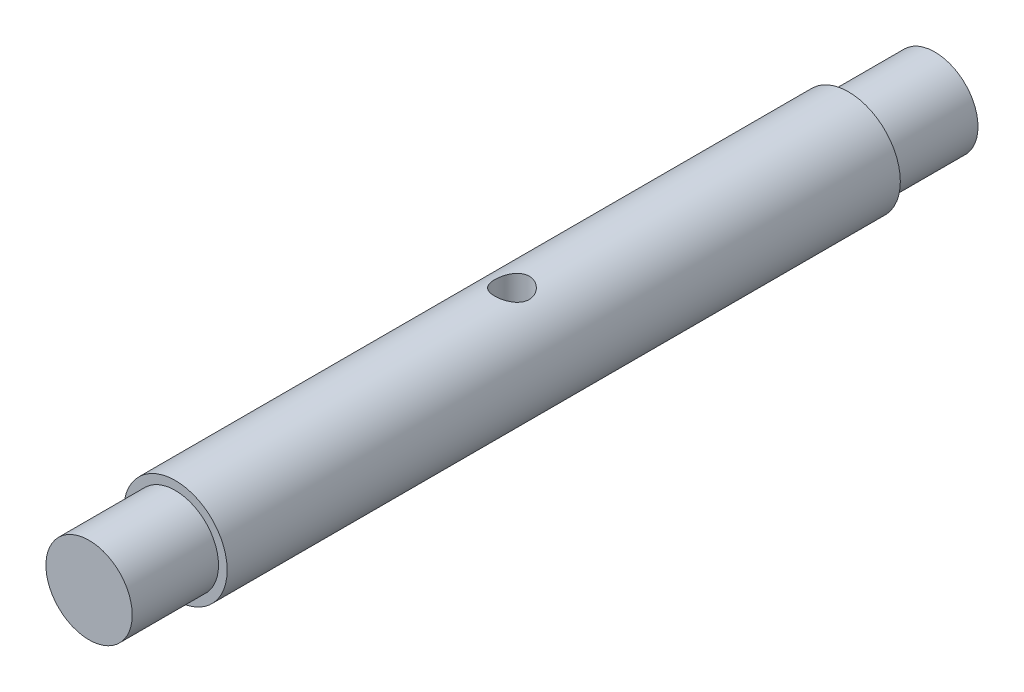
ISO-10303-21;
HEADER;
FILE_DESCRIPTION(('STEP AP214'),'2;1');
FILE_NAME('part.step','',(''),(''),'','','');
FILE_SCHEMA(('AUTOMOTIVE_DESIGN { 1 0 10303 214 1 1 1 1 }'));
ENDSEC;
DATA;
#1=APPLICATION_CONTEXT('core data for automotive mechanical design processes');
#2=APPLICATION_PROTOCOL_DEFINITION('international standard','automotive_design',2000,#1);
#3=PRODUCT_CONTEXT('',#1,'mechanical');
#4=PRODUCT('Part','Part','',(#3));
#5=PRODUCT_RELATED_PRODUCT_CATEGORY('part','',(#4));
#6=PRODUCT_DEFINITION_FORMATION('','',#4);
#7=PRODUCT_DEFINITION_CONTEXT('part definition',#1,'design');
#8=PRODUCT_DEFINITION('design','',#6,#7);
#9=PRODUCT_DEFINITION_SHAPE('','',#8);
#10=(LENGTH_UNIT() NAMED_UNIT(*) SI_UNIT(.MILLI.,.METRE.));
#11=(NAMED_UNIT(*) PLANE_ANGLE_UNIT() SI_UNIT($,.RADIAN.));
#12=(NAMED_UNIT(*) SI_UNIT($,.STERADIAN.) SOLID_ANGLE_UNIT());
#13=UNCERTAINTY_MEASURE_WITH_UNIT(LENGTH_MEASURE(1.E-05),#10,'distance_accuracy_value','');
#14=(GEOMETRIC_REPRESENTATION_CONTEXT(3) GLOBAL_UNCERTAINTY_ASSIGNED_CONTEXT((#13)) GLOBAL_UNIT_ASSIGNED_CONTEXT((#10,
#11,#12)) REPRESENTATION_CONTEXT('',''));
#15=CARTESIAN_POINT('',(0.,0.,0.));
#16=DIRECTION('',(0.,0.,1.));
#17=DIRECTION('',(1.,0.,0.));
#18=AXIS2_PLACEMENT_3D('',#15,#16,#17);
#19=CARTESIAN_POINT('',(0.,0.,24.5));
#20=DIRECTION('',(0.,0.,1.));
#21=DIRECTION('',(1.,0.,0.));
#22=AXIS2_PLACEMENT_3D('',#19,#20,#21);
#23=CYLINDRICAL_SURFACE('',#22,2.99999999999998);
#24=CARTESIAN_POINT('',(0.,-2.99999999999998,-1.));
#25=CARTESIAN_POINT('',(-0.0545633628867232,-3.00000015300941,-1.00000025373164));
#26=CARTESIAN_POINT('',(-0.10912519453855,-2.99849769507542,-0.995519733872783));
#27=CARTESIAN_POINT('',(-0.216641760872972,-2.99265210203279,-0.977770891182781));
#28=CARTESIAN_POINT('',(-0.269596328118817,-2.9883086720215,-0.964501656051078));
#29=CARTESIAN_POINT('',(-0.372332789501776,-2.9772530790644,-0.929680756615952));
#30=CARTESIAN_POINT('',(-0.422119825886034,-2.97054487730851,-0.908142937540729));
#31=CARTESIAN_POINT('',(-0.517374936805324,-2.9554444571734,-0.857458827161653));
#32=CARTESIAN_POINT('',(-0.562842156958705,-2.94705190667776,-0.828311034997399));
#33=CARTESIAN_POINT('',(-0.649741675022266,-2.92914094443003,-0.762174195141248));
#34=CARTESIAN_POINT('',(-0.691003700298309,-2.91959556463783,-0.724968765739507));
#35=CARTESIAN_POINT('',(-0.766832692702083,-2.90060314783119,-0.644232845293435));
#36=CARTESIAN_POINT('',(-0.801398185489462,-2.89115613290547,-0.600700965071489));
#37=CARTESIAN_POINT('',(-0.863824942227858,-2.87313332477272,-0.507014884803542));
#38=CARTESIAN_POINT('',(-0.891464858221031,-2.86459039275686,-0.456706260267879));
#39=CARTESIAN_POINT('',(-0.937818873877721,-2.84975305418599,-0.351823905541455));
#40=CARTESIAN_POINT('',(-0.956535697386764,-2.84345796160744,-0.297251482837258));
#41=CARTESIAN_POINT('',(-0.983873461509163,-2.83411303269375,-0.187326778503291));
#42=CARTESIAN_POINT('',(-0.992813448271769,-2.83096095769609,-0.132062791510937));
#43=CARTESIAN_POINT('',(-1.00134112333448,-2.82795656629506,-0.0207362458441206));
#44=CARTESIAN_POINT('',(-1.00093170160472,-2.82810323022728,0.0353260607091891));
#45=CARTESIAN_POINT('',(-0.991019903703419,-2.83159015008178,0.14393663044402));
#46=CARTESIAN_POINT('',(-0.981933913166995,-2.83478415867531,0.196528402919017));
#47=CARTESIAN_POINT('',(-0.955606162849417,-2.84376657724549,0.299393419606833));
#48=CARTESIAN_POINT('',(-0.938363426591871,-2.84955529784106,0.349666385435069));
#49=CARTESIAN_POINT('',(-0.895939058060211,-2.86317911131247,0.447412749591478));
#50=CARTESIAN_POINT('',(-0.870634048707263,-2.87104565793115,0.494828025469525));
#51=CARTESIAN_POINT('',(-0.812889106303139,-2.88792558575724,0.584870908279726));
#52=CARTESIAN_POINT('',(-0.780447112364006,-2.89693929790461,0.627497126933381));
#53=CARTESIAN_POINT('',(-0.707349332682238,-2.91567329167739,0.709091598160772));
#54=CARTESIAN_POINT('',(-0.666353150076312,-2.92540589354841,0.747752694509069));
#55=CARTESIAN_POINT('',(-0.578339569970064,-2.94406938387035,0.817731266663397));
#56=CARTESIAN_POINT('',(-0.531321595660815,-2.95300019538065,0.849048038164496));
#57=CARTESIAN_POINT('',(-0.431947613046268,-2.96917107937791,0.903696300235068));
#58=CARTESIAN_POINT('',(-0.379543276416337,-2.97639350008037,0.926945491340731));
#59=CARTESIAN_POINT('',(-0.271269083364508,-2.98820567144432,0.964203173955711));
#60=CARTESIAN_POINT('',(-0.215400438154955,-2.99279633654876,0.978214875423438));
#61=CARTESIAN_POINT('',(-0.104383829529305,-2.99867627071439,0.996055666022358));
#62=CARTESIAN_POINT('',(-0.0493095998648461,-3.00010001833728,1.00029980917275));
#63=CARTESIAN_POINT('',(0.0607750699602354,-2.99988902694822,0.999667326401534));
#64=CARTESIAN_POINT('',(0.115785519319646,-2.9982548041935,0.994792240020132));
#65=CARTESIAN_POINT('',(0.222519866304258,-2.99220024717112,0.976388092264033));
#66=CARTESIAN_POINT('',(0.274292806834855,-2.98786198711226,0.963113793950476));
#67=CARTESIAN_POINT('',(0.37485595857956,-2.97691846830032,0.928606555533302));
#68=CARTESIAN_POINT('',(0.423645788508558,-2.97031292046539,0.907372600532326));
#69=CARTESIAN_POINT('',(0.51828829639332,-2.95528931287425,0.856929568159101));
#70=CARTESIAN_POINT('',(0.564029959217328,-2.94682814756302,0.827525406716401));
#71=CARTESIAN_POINT('',(0.650064830135403,-2.92905253915741,0.761805849986947));
#72=CARTESIAN_POINT('',(0.690356367794893,-2.91973783591885,0.725488343969839));
#73=CARTESIAN_POINT('',(0.766252507807012,-2.9007684798247,0.645021248991737));
#74=CARTESIAN_POINT('',(0.801560969248491,-2.89111761095153,0.600590773066753));
#75=CARTESIAN_POINT('',(0.864257522320853,-2.87299973286978,0.506228432195501));
#76=CARTESIAN_POINT('',(0.891645547920843,-2.86453273353117,0.456296521389799));
#77=CARTESIAN_POINT('',(0.93759693042336,-2.84982391820305,0.352326984693407));
#78=CARTESIAN_POINT('',(0.956178132197766,-2.84357760900629,0.298297920757222));
#79=CARTESIAN_POINT('',(0.983894666792162,-2.8341083239913,0.187621349875852));
#80=CARTESIAN_POINT('',(0.993034254961243,-2.83088398622695,0.130975034566939));
#81=CARTESIAN_POINT('',(1.00127628247038,-2.82797858875068,0.0198029039867906));
#82=CARTESIAN_POINT('',(1.00087025731093,-2.82812400344296,-0.0346823402517351));
#83=CARTESIAN_POINT('',(0.991242293454878,-2.83151269923557,-0.142765074899741));
#84=CARTESIAN_POINT('',(0.982020879458887,-2.83475579595881,-0.196362617952909));
#85=CARTESIAN_POINT('',(0.955371813126981,-2.8438452427894,-0.300135663012665));
#86=CARTESIAN_POINT('',(0.93810334601488,-2.84964098015511,-0.35035682500723));
#87=CARTESIAN_POINT('',(0.895979365760383,-2.86316398825431,-0.44722740693553));
#88=CARTESIAN_POINT('',(0.87112216855398,-2.87089168765294,-0.493876031187257));
#89=CARTESIAN_POINT('',(0.81326069258325,-2.88782829224057,-0.58448366992369));
#90=CARTESIAN_POINT('',(0.779948242764534,-2.89708711641601,-0.628236501898593));
#91=CARTESIAN_POINT('',(0.706642883135699,-2.91583356283783,-0.709689813383989));
#92=CARTESIAN_POINT('',(0.666648084451497,-2.92532124912515,-0.747388575688016));
#93=CARTESIAN_POINT('',(0.579241556920677,-2.9439003052539,-0.817144412289236));
#94=CARTESIAN_POINT('',(0.531601513499728,-2.95296181801213,-0.848924347751014));
#95=CARTESIAN_POINT('',(0.431357357406631,-2.9692599117265,-0.903990428850629));
#96=CARTESIAN_POINT('',(0.378754518132352,-2.97649695907938,-0.927278745922037));
#97=CARTESIAN_POINT('',(0.272493647200978,-2.98805515068529,-0.963721632488675));
#98=CARTESIAN_POINT('',(0.218987757676411,-2.99249212422517,-0.977282466263377));
#99=CARTESIAN_POINT('',(0.110320416010249,-2.99846407064222,-0.995420280677125));
#100=CARTESIAN_POINT('',(0.0551594255687471,-2.99999984531903,-0.999999743496537));
#101=CARTESIAN_POINT('',(0.,-2.99999999999998,-1.));
#102=B_SPLINE_CURVE_WITH_KNOTS('',3,(#24,#25,#26,#27,#28,#29,#30,#31,#32,#33,#34,#35,#36,#37,
#38,#39,#40,#41,#42,#43,#44,#45,#46,#47,#48,#49,#50,#51,#52,#53,#54,#55,#56,#57,#58,#59,#60,#61,
#62,#63,#64,#65,#66,#67,#68,#69,#70,#71,#72,#73,#74,#75,#76,#77,#78,#79,#80,#81,#82,#83,#84,#85,
#86,#87,#88,#89,#90,#91,#92,#93,#94,#95,#96,#97,#98,#99,#100,#101),.UNSPECIFIED.,.T.,.F.,(4,2,2,
2,2,2,2,2,2,2,2,2,2,2,2,2,2,2,2,2,2,2,2,2,2,2,2,2,2,2,2,2,2,2,2,2,2,2,4),(0.,0.163487106026011,
0.32699118526752,0.490222672870273,0.653486377799099,0.821846842827558,0.990244332875301,
1.1634838482347,1.33667044692833,1.5040192574184,1.67131633987485,1.8309682655128,
1.99063930855482,2.1528817115513,2.31517102558207,2.48593305811367,2.65671145966618,
2.82918405650357,3.00159668877208,3.16653583175169,3.33144713164176,3.49158157978213,
3.65173645284104,3.81610399843736,3.98052180821891,4.15241022880752,4.32430008234997,
4.49584013824416,4.66730284700846,4.82995666056618,4.99260079341185,5.15215587070227,
5.31174638165787,5.47830066681614,5.64490211113589,5.8179966082491,5.99104681142266,
6.15636558363624,6.3216386602795),.UNSPECIFIED.);
#103=CARTESIAN_POINT('',(0.,-2.99999999999998,-1.));
#104=VERTEX_POINT('',#103);
#105=EDGE_CURVE('E49',#104,#104,#102,.T.);
#106=ORIENTED_EDGE('',*,*,#105,.T.);
#107=EDGE_LOOP('',(#106));
#108=FACE_BOUND('',#107,.T.);
#109=CARTESIAN_POINT('',(0.,0.,-19.5));
#110=DIRECTION('',(0.,0.,1.));
#111=DIRECTION('',(1.,0.,0.));
#112=AXIS2_PLACEMENT_3D('',#109,#110,#111);
#113=CIRCLE('',#112,2.99999999999998);
#114=CARTESIAN_POINT('',(2.99999999999996,0.,-19.5));
#115=VERTEX_POINT('',#114);
#116=EDGE_CURVE('E90',#115,#115,#113,.T.);
#117=ORIENTED_EDGE('',*,*,#116,.T.);
#118=EDGE_LOOP('',(#117));
#119=FACE_BOUND('',#118,.T.);
#120=CARTESIAN_POINT('',(0.,0.,19.5));
#121=DIRECTION('',(0.,0.,1.));
#122=DIRECTION('',(1.,0.,0.));
#123=AXIS2_PLACEMENT_3D('',#120,#121,#122);
#124=CIRCLE('',#123,2.99999999999997);
#125=CARTESIAN_POINT('',(2.99999999999996,0.,19.5));
#126=VERTEX_POINT('',#125);
#127=EDGE_CURVE('E46',#126,#126,#124,.T.);
#128=ORIENTED_EDGE('',*,*,#127,.F.);
#129=EDGE_LOOP('',(#128));
#130=FACE_BOUND('',#129,.T.);
#131=CARTESIAN_POINT('',(0.,2.99999999999998,-1.));
#132=CARTESIAN_POINT('',(0.0545633628867233,3.00000015300941,-1.00000025373164));
#133=CARTESIAN_POINT('',(0.10912519453855,2.99849769507542,-0.995519733872783));
#134=CARTESIAN_POINT('',(0.216641760872972,2.99265210203278,-0.977770891182781));
#135=CARTESIAN_POINT('',(0.269596328118818,2.9883086720215,-0.964501656051078));
#136=CARTESIAN_POINT('',(0.372332789501776,2.9772530790644,-0.929680756615952));
#137=CARTESIAN_POINT('',(0.422119825886034,2.97054487730851,-0.908142937540728));
#138=CARTESIAN_POINT('',(0.517374936805325,2.95544445717339,-0.857458827161653));
#139=CARTESIAN_POINT('',(0.562842156958706,2.94705190667775,-0.828311034997399));
#140=CARTESIAN_POINT('',(0.649741675022266,2.92914094443002,-0.762174195141247));
#141=CARTESIAN_POINT('',(0.691003700298309,2.91959556463782,-0.724968765739507));
#142=CARTESIAN_POINT('',(0.766832692702084,2.90060314783119,-0.644232845293434));
#143=CARTESIAN_POINT('',(0.801398185489463,2.89115613290546,-0.600700965071487));
#144=CARTESIAN_POINT('',(0.863824942227859,2.87313332477271,-0.50701488480354));
#145=CARTESIAN_POINT('',(0.891464858221032,2.86459039275685,-0.456706260267877));
#146=CARTESIAN_POINT('',(0.937818873877722,2.84975305418598,-0.351823905541453));
#147=CARTESIAN_POINT('',(0.956535697386765,2.84345796160743,-0.297251482837255));
#148=CARTESIAN_POINT('',(0.983873461509164,2.83411303269374,-0.187326778503289));
#149=CARTESIAN_POINT('',(0.992813448271769,2.83096095769608,-0.132062791510935));
#150=CARTESIAN_POINT('',(1.00134112333448,2.82795656629505,-0.0207362458441184));
#151=CARTESIAN_POINT('',(1.00093170160472,2.82810323022727,0.0353260607091911));
#152=CARTESIAN_POINT('',(0.991019903703419,2.83159015008177,0.143936630444022));
#153=CARTESIAN_POINT('',(0.981933913166995,2.8347841586753,0.196528402919019));
#154=CARTESIAN_POINT('',(0.955606162849417,2.84376657724548,0.299393419606834));
#155=CARTESIAN_POINT('',(0.938363426591871,2.84955529784105,0.34966638543507));
#156=CARTESIAN_POINT('',(0.895939058060211,2.86317911131246,0.447412749591478));
#157=CARTESIAN_POINT('',(0.870634048707263,2.87104565793114,0.494828025469525));
#158=CARTESIAN_POINT('',(0.81288910630314,2.88792558575723,0.584870908279726));
#159=CARTESIAN_POINT('',(0.780447112364006,2.89693929790461,0.627497126933381));
#160=CARTESIAN_POINT('',(0.707349332682238,2.91567329167738,0.709091598160772));
#161=CARTESIAN_POINT('',(0.666353150076312,2.9254058935484,0.747752694509069));
#162=CARTESIAN_POINT('',(0.578339569970065,2.94406938387034,0.817731266663397));
#163=CARTESIAN_POINT('',(0.531321595660815,2.95300019538065,0.849048038164495));
#164=CARTESIAN_POINT('',(0.431947613046269,2.96917107937791,0.903696300235068));
#165=CARTESIAN_POINT('',(0.379543276416338,2.97639350008037,0.926945491340731));
#166=CARTESIAN_POINT('',(0.271269083364509,2.98820567144432,0.964203173955711));
#167=CARTESIAN_POINT('',(0.215400438154955,2.99279633654876,0.978214875423438));
#168=CARTESIAN_POINT('',(0.104383829529305,2.99867627071439,0.996055666022358));
#169=CARTESIAN_POINT('',(0.049309599864846,3.00010001833728,1.00029980917275));
#170=CARTESIAN_POINT('',(-0.0607750699602358,2.99988902694822,0.999667326401534));
#171=CARTESIAN_POINT('',(-0.115785519319646,2.9982548041935,0.994792240020132));
#172=CARTESIAN_POINT('',(-0.222519866304259,2.99220024717112,0.976388092264033));
#173=CARTESIAN_POINT('',(-0.274292806834856,2.98786198711226,0.963113793950476));
#174=CARTESIAN_POINT('',(-0.37485595857956,2.97691846830032,0.928606555533301));
#175=CARTESIAN_POINT('',(-0.423645788508559,2.97031292046539,0.907372600532325));
#176=CARTESIAN_POINT('',(-0.518288296393321,2.95528931287425,0.856929568159101));
#177=CARTESIAN_POINT('',(-0.564029959217329,2.94682814756303,0.827525406716401));
#178=CARTESIAN_POINT('',(-0.650064830135403,2.92905253915741,0.761805849986946));
#179=CARTESIAN_POINT('',(-0.690356367794893,2.91973783591886,0.725488343969839));
#180=CARTESIAN_POINT('',(-0.766252507807013,2.9007684798247,0.645021248991736));
#181=CARTESIAN_POINT('',(-0.801560969248491,2.89111761095153,0.600590773066752));
#182=CARTESIAN_POINT('',(-0.864257522320853,2.87299973286979,0.506228432195501));
#183=CARTESIAN_POINT('',(-0.891645547920843,2.86453273353118,0.456296521389798));
#184=CARTESIAN_POINT('',(-0.93759693042336,2.84982391820306,0.352326984693407));
#185=CARTESIAN_POINT('',(-0.956178132197766,2.8435776090063,0.298297920757222));
#186=CARTESIAN_POINT('',(-0.983894666792162,2.83410832399131,0.187621349875852));
#187=CARTESIAN_POINT('',(-0.993034254961243,2.83088398622696,0.130975034566938));
#188=CARTESIAN_POINT('',(-1.00127628247038,2.82797858875069,0.0198029039867904));
#189=CARTESIAN_POINT('',(-1.00087025731093,2.82812400344297,-0.0346823402517356));
#190=CARTESIAN_POINT('',(-0.991242293454878,2.83151269923558,-0.142765074899742));
#191=CARTESIAN_POINT('',(-0.982020879458887,2.83475579595882,-0.196362617952909));
#192=CARTESIAN_POINT('',(-0.955371813126981,2.84384524278942,-0.300135663012666));
#193=CARTESIAN_POINT('',(-0.93810334601488,2.84964098015512,-0.350356825007232));
#194=CARTESIAN_POINT('',(-0.895979365760382,2.86316398825432,-0.447227406935532));
#195=CARTESIAN_POINT('',(-0.87112216855398,2.87089168765295,-0.493876031187258));
#196=CARTESIAN_POINT('',(-0.813260692583249,2.88782829224058,-0.584483669923691));
#197=CARTESIAN_POINT('',(-0.779948242764533,2.89708711641602,-0.628236501898594));
#198=CARTESIAN_POINT('',(-0.706642883135698,2.91583356283784,-0.70968981338399));
#199=CARTESIAN_POINT('',(-0.666648084451495,2.92532124912516,-0.747388575688017));
#200=CARTESIAN_POINT('',(-0.579241556920675,2.94390030525391,-0.817144412289237));
#201=CARTESIAN_POINT('',(-0.531601513499725,2.95296181801214,-0.848924347751015));
#202=CARTESIAN_POINT('',(-0.431357357406629,2.9692599117265,-0.903990428850631));
#203=CARTESIAN_POINT('',(-0.37875451813235,2.97649695907938,-0.927278745922038));
#204=CARTESIAN_POINT('',(-0.272493647200975,2.98805515068529,-0.963721632488676));
#205=CARTESIAN_POINT('',(-0.218987757676409,2.99249212422518,-0.977282466263377));
#206=CARTESIAN_POINT('',(-0.110320416010247,2.99846407064222,-0.995420280677125));
#207=CARTESIAN_POINT('',(-0.0551594255687465,2.99999984531903,-0.999999743496537));
#208=CARTESIAN_POINT('',(0.,2.99999999999998,-1.));
#209=B_SPLINE_CURVE_WITH_KNOTS('',3,(#131,#132,#133,#134,#135,#136,#137,#138,#139,#140,#141,
#142,#143,#144,#145,#146,#147,#148,#149,#150,#151,#152,#153,#154,#155,#156,#157,#158,#159,#160,
#161,#162,#163,#164,#165,#166,#167,#168,#169,#170,#171,#172,#173,#174,#175,#176,#177,#178,#179,
#180,#181,#182,#183,#184,#185,#186,#187,#188,#189,#190,#191,#192,#193,#194,#195,#196,#197,#198,
#199,#200,#201,#202,#203,#204,#205,#206,#207,#208),.UNSPECIFIED.,.T.,.F.,(4,2,2,2,2,2,2,2,2,2,2,
2,2,2,2,2,2,2,2,2,2,2,2,2,2,2,2,2,2,2,2,2,2,2,2,2,2,2,4),(0.,0.163487106026011,
0.326991185267521,0.490222672870274,0.653486377799101,0.821846842827561,0.990244332875303,
1.16348384823471,1.33667044692834,1.5040192574184,1.67131633987486,1.8309682655128,
1.99063930855482,2.15288171155131,2.31517102558207,2.48593305811367,2.65671145966618,
2.82918405650358,3.00159668877208,3.1665358317517,3.33144713164177,3.49158157978214,
3.65173645284104,3.81610399843737,3.98052180821891,4.15241022880752,4.32430008234997,
4.49584013824416,4.66730284700846,4.82995666056619,4.99260079341185,5.15215587070228,
5.31174638165788,5.47830066681615,5.64490211113589,5.81799660824911,5.99104681142267,
6.15636558363624,6.3216386602795),.UNSPECIFIED.);
#210=CARTESIAN_POINT('',(0.,2.99999999999998,-1.));
#211=VERTEX_POINT('',#210);
#212=EDGE_CURVE('E33',#211,#211,#209,.T.);
#213=ORIENTED_EDGE('',*,*,#212,.T.);
#214=EDGE_LOOP('',(#213));
#215=FACE_BOUND('',#214,.T.);
#216=ADVANCED_FACE('F29',(#108,#119,#130,#215),#23,.T.);
#217=CARTESIAN_POINT('',(0.,0.,24.5));
#218=DIRECTION('',(0.,0.,1.));
#219=DIRECTION('',(1.,0.,0.));
#220=AXIS2_PLACEMENT_3D('',#217,#218,#219);
#221=PLANE('',#220);
#222=CARTESIAN_POINT('',(0.,0.,24.5));
#223=DIRECTION('',(0.,0.,1.));
#224=DIRECTION('',(1.,0.,0.));
#225=AXIS2_PLACEMENT_3D('',#222,#223,#224);
#226=CIRCLE('',#225,2.5);
#227=CARTESIAN_POINT('',(2.5,0.,24.5));
#228=VERTEX_POINT('',#227);
#229=EDGE_CURVE('E10',#228,#228,#226,.T.);
#230=ORIENTED_EDGE('',*,*,#229,.T.);
#231=EDGE_LOOP('',(#230));
#232=FACE_BOUND('',#231,.T.);
#233=ADVANCED_FACE('F31',(#232),#221,.T.);
#234=CARTESIAN_POINT('',(0.,0.,24.5));
#235=DIRECTION('',(0.,0.,1.));
#236=DIRECTION('',(1.,0.,0.));
#237=AXIS2_PLACEMENT_3D('',#234,#235,#236);
#238=CYLINDRICAL_SURFACE('',#237,2.5);
#239=CARTESIAN_POINT('',(0.,0.,19.5));
#240=DIRECTION('',(0.,0.,1.));
#241=DIRECTION('',(1.,0.,0.));
#242=AXIS2_PLACEMENT_3D('',#239,#240,#241);
#243=CIRCLE('',#242,2.5);
#244=CARTESIAN_POINT('',(2.5,0.,19.5));
#245=VERTEX_POINT('',#244);
#246=EDGE_CURVE('E41',#245,#245,#243,.T.);
#247=ORIENTED_EDGE('',*,*,#246,.T.);
#248=EDGE_LOOP('',(#247));
#249=FACE_BOUND('',#248,.T.);
#250=ORIENTED_EDGE('',*,*,#229,.F.);
#251=EDGE_LOOP('',(#250));
#252=FACE_BOUND('',#251,.T.);
#253=ADVANCED_FACE('F76',(#249,#252),#238,.T.);
#254=CARTESIAN_POINT('',(2.5,0.,19.5));
#255=DIRECTION('',(0.,0.,1.));
#256=DIRECTION('',(1.,0.,0.));
#257=AXIS2_PLACEMENT_3D('',#254,#255,#256);
#258=PLANE('',#257);
#259=ORIENTED_EDGE('',*,*,#127,.T.);
#260=EDGE_LOOP('',(#259));
#261=FACE_BOUND('',#260,.T.);
#262=ORIENTED_EDGE('',*,*,#246,.F.);
#263=EDGE_LOOP('',(#262));
#264=FACE_BOUND('',#263,.T.);
#265=ADVANCED_FACE('F71',(#261,#264),#258,.T.);
#266=CARTESIAN_POINT('',(2.99999999999996,0.,-19.5));
#267=DIRECTION('',(0.,0.,-1.));
#268=DIRECTION('',(-1.,0.,0.));
#269=AXIS2_PLACEMENT_3D('',#266,#267,#268);
#270=PLANE('',#269);
#271=CARTESIAN_POINT('',(0.,0.,-19.5));
#272=DIRECTION('',(0.,0.,1.));
#273=DIRECTION('',(1.,0.,0.));
#274=AXIS2_PLACEMENT_3D('',#271,#272,#273);
#275=CIRCLE('',#274,2.50000000000002);
#276=CARTESIAN_POINT('',(2.49999999999999,0.,-19.5));
#277=VERTEX_POINT('',#276);
#278=EDGE_CURVE('E98',#277,#277,#275,.T.);
#279=ORIENTED_EDGE('',*,*,#278,.T.);
#280=EDGE_LOOP('',(#279));
#281=FACE_BOUND('',#280,.T.);
#282=ORIENTED_EDGE('',*,*,#116,.F.);
#283=EDGE_LOOP('',(#282));
#284=FACE_BOUND('',#283,.T.);
#285=ADVANCED_FACE('F68',(#281,#284),#270,.T.);
#286=CARTESIAN_POINT('',(0.,0.,24.5));
#287=DIRECTION('',(0.,0.,1.));
#288=DIRECTION('',(1.,0.,0.));
#289=AXIS2_PLACEMENT_3D('',#286,#287,#288);
#290=CYLINDRICAL_SURFACE('',#289,2.50000000000002);
#291=CARTESIAN_POINT('',(0.,0.,-24.5));
#292=DIRECTION('',(0.,0.,1.));
#293=DIRECTION('',(1.,0.,0.));
#294=AXIS2_PLACEMENT_3D('',#291,#292,#293);
#295=CIRCLE('',#294,2.50000000000002);
#296=CARTESIAN_POINT('',(2.49999999999999,0.,-24.5));
#297=VERTEX_POINT('',#296);
#298=EDGE_CURVE('E96',#297,#297,#295,.T.);
#299=ORIENTED_EDGE('',*,*,#298,.T.);
#300=EDGE_LOOP('',(#299));
#301=FACE_BOUND('',#300,.T.);
#302=ORIENTED_EDGE('',*,*,#278,.F.);
#303=EDGE_LOOP('',(#302));
#304=FACE_BOUND('',#303,.T.);
#305=ADVANCED_FACE('F65',(#301,#304),#290,.T.);
#306=CARTESIAN_POINT('',(2.49999999999999,0.,-24.5));
#307=DIRECTION('',(0.,0.,-1.));
#308=DIRECTION('',(-1.,0.,0.));
#309=AXIS2_PLACEMENT_3D('',#306,#307,#308);
#310=PLANE('',#309);
#311=ORIENTED_EDGE('',*,*,#298,.F.);
#312=EDGE_LOOP('',(#311));
#313=FACE_BOUND('',#312,.T.);
#314=ADVANCED_FACE('F60',(#313),#310,.T.);
#315=CARTESIAN_POINT('',(0.,10.,0.));
#316=DIRECTION('',(0.,-1.,0.));
#317=DIRECTION('',(0.,0.,-1.));
#318=AXIS2_PLACEMENT_3D('',#315,#316,#317);
#319=CYLINDRICAL_SURFACE('',#318,1.);
#320=ORIENTED_EDGE('',*,*,#212,.F.);
#321=EDGE_LOOP('',(#320));
#322=FACE_BOUND('',#321,.T.);
#323=ORIENTED_EDGE('',*,*,#105,.F.);
#324=EDGE_LOOP('',(#323));
#325=FACE_BOUND('',#324,.T.);
#326=ADVANCED_FACE('F56',(#322,#325),#319,.F.);
#327=CLOSED_SHELL('',(#216,#233,#253,#265,#285,#305,#314,#326));
#328=MANIFOLD_SOLID_BREP('B2',#327);
#329=ADVANCED_BREP_SHAPE_REPRESENTATION('',(#18,#328),#14);
#330=SHAPE_DEFINITION_REPRESENTATION(#9,#329);
ENDSEC;
END-ISO-10303-21;
